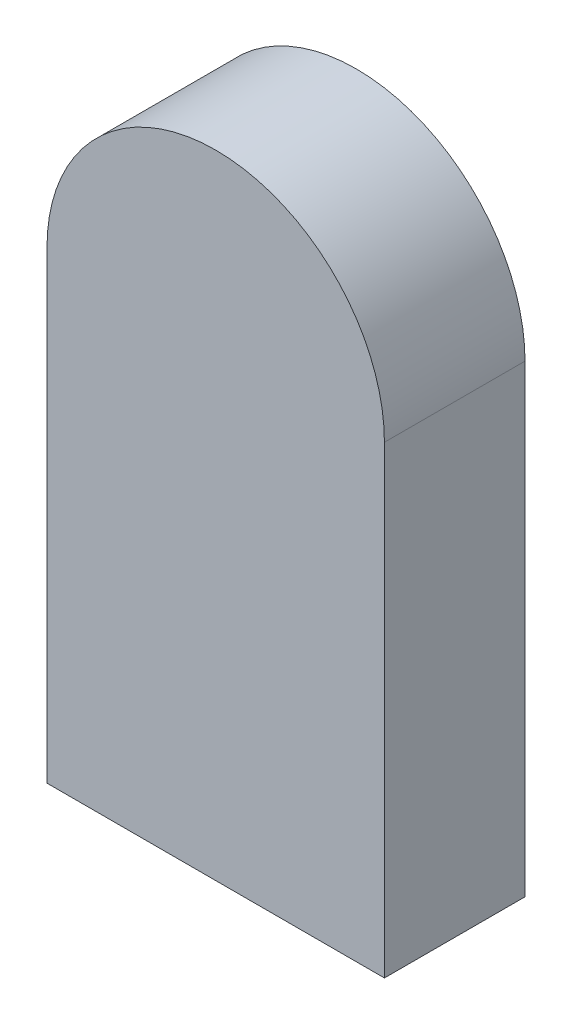
ISO-10303-21;
HEADER;
FILE_DESCRIPTION(('STEP AP214'),'2;1');
FILE_NAME('part.step','',(''),(''),'','','');
FILE_SCHEMA(('AUTOMOTIVE_DESIGN { 1 0 10303 214 1 1 1 1 }'));
ENDSEC;
DATA;
#1=APPLICATION_CONTEXT('core data for automotive mechanical design processes');
#2=APPLICATION_PROTOCOL_DEFINITION('international standard','automotive_design',2000,#1);
#3=PRODUCT_CONTEXT('',#1,'mechanical');
#4=PRODUCT('Part','Part','',(#3));
#5=PRODUCT_RELATED_PRODUCT_CATEGORY('part','',(#4));
#6=PRODUCT_DEFINITION_FORMATION('','',#4);
#7=PRODUCT_DEFINITION_CONTEXT('part definition',#1,'design');
#8=PRODUCT_DEFINITION('design','',#6,#7);
#9=PRODUCT_DEFINITION_SHAPE('','',#8);
#10=(LENGTH_UNIT() NAMED_UNIT(*) SI_UNIT(.MILLI.,.METRE.));
#11=(NAMED_UNIT(*) PLANE_ANGLE_UNIT() SI_UNIT($,.RADIAN.));
#12=(NAMED_UNIT(*) SI_UNIT($,.STERADIAN.) SOLID_ANGLE_UNIT());
#13=UNCERTAINTY_MEASURE_WITH_UNIT(LENGTH_MEASURE(1.E-05),#10,'distance_accuracy_value','');
#14=(GEOMETRIC_REPRESENTATION_CONTEXT(3) GLOBAL_UNCERTAINTY_ASSIGNED_CONTEXT((#13)) GLOBAL_UNIT_ASSIGNED_CONTEXT((#10,
#11,#12)) REPRESENTATION_CONTEXT('',''));
#15=CARTESIAN_POINT('',(0.,0.,0.));
#16=DIRECTION('',(0.,0.,1.));
#17=DIRECTION('',(1.,0.,0.));
#18=AXIS2_PLACEMENT_3D('',#15,#16,#17);
#19=CARTESIAN_POINT('',(0.63,-4.05,0.));
#20=DIRECTION('',(0.,1.,0.));
#21=DIRECTION('',(1.,0.,0.));
#22=AXIS2_PLACEMENT_3D('',#19,#20,#21);
#23=PLANE('',#22);
#24=DIRECTION('',(1.,0.,0.));
#25=VECTOR('',#24,1.);
#26=CARTESIAN_POINT('',(0.63,-4.05,0.));
#27=LINE('',#26,#25);
#28=CARTESIAN_POINT('',(0.63,-4.05,0.));
#29=VERTEX_POINT('',#28);
#30=CARTESIAN_POINT('',(0.87,-4.05,0.));
#31=VERTEX_POINT('',#30);
#32=EDGE_CURVE('E11',#29,#31,#27,.T.);
#33=ORIENTED_EDGE('',*,*,#32,.T.);
#34=DIRECTION('',(0.,0.,1.));
#35=VECTOR('',#34,1.);
#36=CARTESIAN_POINT('',(0.87,-4.05,0.));
#37=LINE('',#36,#35);
#38=CARTESIAN_POINT('',(0.87,-4.05,0.1));
#39=VERTEX_POINT('',#38);
#40=EDGE_CURVE('E24',#31,#39,#37,.T.);
#41=ORIENTED_EDGE('',*,*,#40,.T.);
#42=DIRECTION('',(1.,0.,0.));
#43=VECTOR('',#42,1.);
#44=CARTESIAN_POINT('',(0.63,-4.05,0.1));
#45=LINE('',#44,#43);
#46=CARTESIAN_POINT('',(0.63,-4.05,0.1));
#47=VERTEX_POINT('',#46);
#48=EDGE_CURVE('E87',#47,#39,#45,.T.);
#49=ORIENTED_EDGE('',*,*,#48,.F.);
#50=DIRECTION('',(0.,0.,1.));
#51=VECTOR('',#50,1.);
#52=CARTESIAN_POINT('',(0.63,-4.05,0.));
#53=LINE('',#52,#51);
#54=EDGE_CURVE('E36',#29,#47,#53,.T.);
#55=ORIENTED_EDGE('',*,*,#54,.F.);
#56=EDGE_LOOP('',(#33,#41,#49,#55));
#57=FACE_BOUND('',#56,.T.);
#58=ADVANCED_FACE('F17',(#57),#23,.F.);
#59=CARTESIAN_POINT('',(0.87,-4.05,0.));
#60=DIRECTION('',(-1.,0.,0.));
#61=DIRECTION('',(0.,1.,0.));
#62=AXIS2_PLACEMENT_3D('',#59,#60,#61);
#63=PLANE('',#62);
#64=DIRECTION('',(0.,1.,0.));
#65=VECTOR('',#64,1.);
#66=CARTESIAN_POINT('',(0.87,-4.05,0.));
#67=LINE('',#66,#65);
#68=CARTESIAN_POINT('',(0.87,-3.72,0.));
#69=VERTEX_POINT('',#68);
#70=EDGE_CURVE('E84',#31,#69,#67,.T.);
#71=ORIENTED_EDGE('',*,*,#70,.T.);
#72=DIRECTION('',(0.,0.,1.));
#73=VECTOR('',#72,1.);
#74=CARTESIAN_POINT('',(0.87,-3.72,0.));
#75=LINE('',#74,#73);
#76=CARTESIAN_POINT('',(0.87,-3.72,0.1));
#77=VERTEX_POINT('',#76);
#78=EDGE_CURVE('E82',#69,#77,#75,.T.);
#79=ORIENTED_EDGE('',*,*,#78,.T.);
#80=DIRECTION('',(0.,1.,0.));
#81=VECTOR('',#80,1.);
#82=CARTESIAN_POINT('',(0.87,-4.05,0.1));
#83=LINE('',#82,#81);
#84=EDGE_CURVE('E72',#39,#77,#83,.T.);
#85=ORIENTED_EDGE('',*,*,#84,.F.);
#86=ORIENTED_EDGE('',*,*,#40,.F.);
#87=EDGE_LOOP('',(#71,#79,#85,#86));
#88=FACE_BOUND('',#87,.T.);
#89=ADVANCED_FACE('F89',(#88),#63,.F.);
#90=CARTESIAN_POINT('',(0.75,-3.72,0.));
#91=DIRECTION('',(0.,0.,-1.));
#92=DIRECTION('',(1.,0.,0.));
#93=AXIS2_PLACEMENT_3D('',#90,#91,#92);
#94=CYLINDRICAL_SURFACE('',#93,0.12);
#95=CARTESIAN_POINT('',(0.75,-3.72,0.));
#96=DIRECTION('',(0.,0.,1.));
#97=DIRECTION('',(1.,0.,0.));
#98=AXIS2_PLACEMENT_3D('',#95,#96,#97);
#99=CIRCLE('',#98,0.12);
#100=CARTESIAN_POINT('',(0.63,-3.72,0.));
#101=VERTEX_POINT('',#100);
#102=EDGE_CURVE('E62',#69,#101,#99,.T.);
#103=ORIENTED_EDGE('',*,*,#102,.T.);
#104=DIRECTION('',(0.,0.,1.));
#105=VECTOR('',#104,1.);
#106=CARTESIAN_POINT('',(0.63,-3.72,0.));
#107=LINE('',#106,#105);
#108=CARTESIAN_POINT('',(0.63,-3.72,0.1));
#109=VERTEX_POINT('',#108);
#110=EDGE_CURVE('E57',#101,#109,#107,.T.);
#111=ORIENTED_EDGE('',*,*,#110,.T.);
#112=CARTESIAN_POINT('',(0.75,-3.72,0.1));
#113=DIRECTION('',(0.,0.,1.));
#114=DIRECTION('',(1.,0.,0.));
#115=AXIS2_PLACEMENT_3D('',#112,#113,#114);
#116=CIRCLE('',#115,0.12);
#117=EDGE_CURVE('E60',#77,#109,#116,.T.);
#118=ORIENTED_EDGE('',*,*,#117,.F.);
#119=ORIENTED_EDGE('',*,*,#78,.F.);
#120=EDGE_LOOP('',(#103,#111,#118,#119));
#121=FACE_BOUND('',#120,.T.);
#122=ADVANCED_FACE('F59',(#121),#94,.T.);
#123=CARTESIAN_POINT('',(0.63,-4.05,0.));
#124=DIRECTION('',(-1.,0.,0.));
#125=DIRECTION('',(0.,1.,0.));
#126=AXIS2_PLACEMENT_3D('',#123,#124,#125);
#127=PLANE('',#126);
#128=ORIENTED_EDGE('',*,*,#54,.T.);
#129=DIRECTION('',(0.,1.,0.));
#130=VECTOR('',#129,1.);
#131=CARTESIAN_POINT('',(0.63,-4.05,0.1));
#132=LINE('',#131,#130);
#133=EDGE_CURVE('E71',#47,#109,#132,.T.);
#134=ORIENTED_EDGE('',*,*,#133,.T.);
#135=ORIENTED_EDGE('',*,*,#110,.F.);
#136=DIRECTION('',(0.,1.,0.));
#137=VECTOR('',#136,1.);
#138=CARTESIAN_POINT('',(0.63,-4.05,0.));
#139=LINE('',#138,#137);
#140=EDGE_CURVE('E76',#29,#101,#139,.T.);
#141=ORIENTED_EDGE('',*,*,#140,.F.);
#142=EDGE_LOOP('',(#128,#134,#135,#141));
#143=FACE_BOUND('',#142,.T.);
#144=ADVANCED_FACE('F75',(#143),#127,.T.);
#145=CARTESIAN_POINT('',(0.75,-3.849490847913,0.));
#146=DIRECTION('',(0.,0.,1.));
#147=DIRECTION('',(1.,0.,0.));
#148=AXIS2_PLACEMENT_3D('',#145,#146,#147);
#149=PLANE('',#148);
#150=ORIENTED_EDGE('',*,*,#140,.T.);
#151=ORIENTED_EDGE('',*,*,#102,.F.);
#152=ORIENTED_EDGE('',*,*,#70,.F.);
#153=ORIENTED_EDGE('',*,*,#32,.F.);
#154=EDGE_LOOP('',(#150,#151,#152,#153));
#155=FACE_BOUND('',#154,.T.);
#156=ADVANCED_FACE('F91',(#155),#149,.F.);
#157=CARTESIAN_POINT('',(0.75,-3.849490847913,0.1));
#158=DIRECTION('',(0.,0.,1.));
#159=DIRECTION('',(1.,0.,0.));
#160=AXIS2_PLACEMENT_3D('',#157,#158,#159);
#161=PLANE('',#160);
#162=ORIENTED_EDGE('',*,*,#48,.T.);
#163=ORIENTED_EDGE('',*,*,#84,.T.);
#164=ORIENTED_EDGE('',*,*,#117,.T.);
#165=ORIENTED_EDGE('',*,*,#133,.F.);
#166=EDGE_LOOP('',(#162,#163,#164,#165));
#167=FACE_BOUND('',#166,.T.);
#168=ADVANCED_FACE('F70',(#167),#161,.T.);
#169=CLOSED_SHELL('',(#58,#89,#122,#144,#156,#168));
#170=MANIFOLD_SOLID_BREP('B1',#169);
#171=ADVANCED_BREP_SHAPE_REPRESENTATION('',(#18,#170),#14);
#172=SHAPE_DEFINITION_REPRESENTATION(#9,#171);
ENDSEC;
END-ISO-10303-21;
